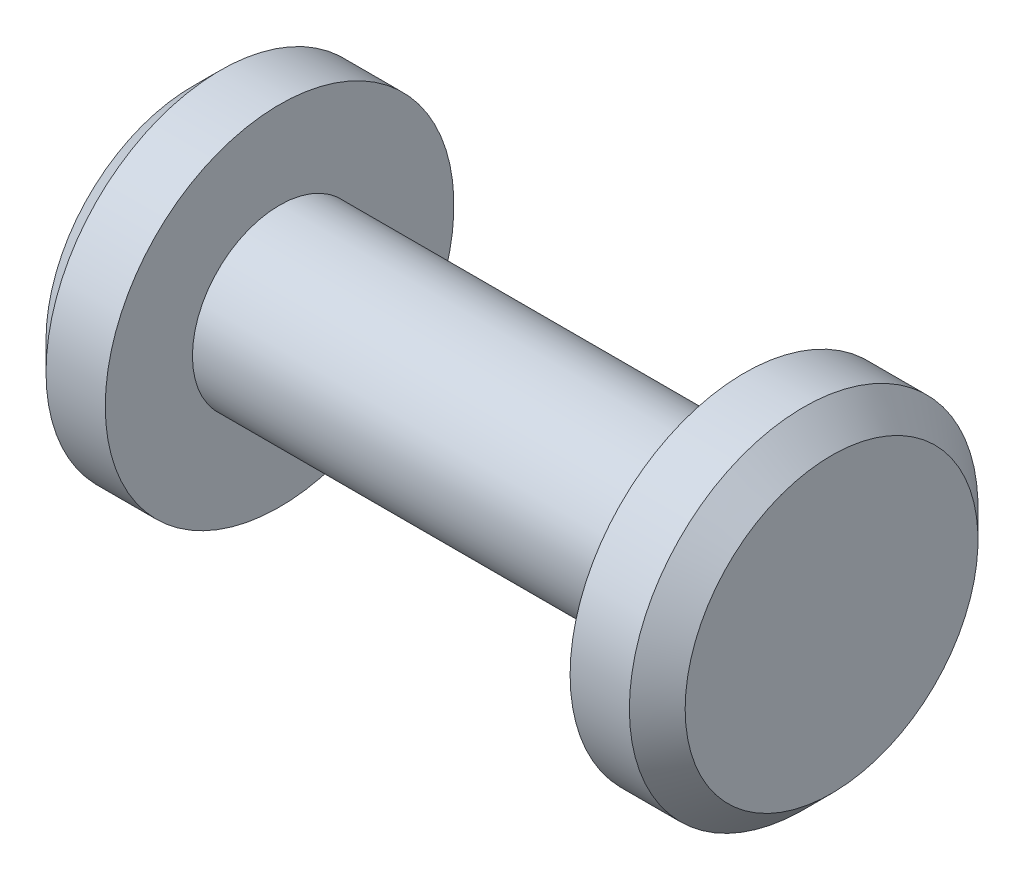
ISO-10303-21;
HEADER;
FILE_DESCRIPTION(('STEP AP214'),'2;1');
FILE_NAME('part.step','',(''),(''),'','','');
FILE_SCHEMA(('AUTOMOTIVE_DESIGN { 1 0 10303 214 1 1 1 1 }'));
ENDSEC;
DATA;
#1=APPLICATION_CONTEXT('core data for automotive mechanical design processes');
#2=APPLICATION_PROTOCOL_DEFINITION('international standard','automotive_design',2000,#1);
#3=PRODUCT_CONTEXT('',#1,'mechanical');
#4=PRODUCT('Part','Part','',(#3));
#5=PRODUCT_RELATED_PRODUCT_CATEGORY('part','',(#4));
#6=PRODUCT_DEFINITION_FORMATION('','',#4);
#7=PRODUCT_DEFINITION_CONTEXT('part definition',#1,'design');
#8=PRODUCT_DEFINITION('design','',#6,#7);
#9=PRODUCT_DEFINITION_SHAPE('','',#8);
#10=(LENGTH_UNIT() NAMED_UNIT(*) SI_UNIT(.MILLI.,.METRE.));
#11=(NAMED_UNIT(*) PLANE_ANGLE_UNIT() SI_UNIT($,.RADIAN.));
#12=(NAMED_UNIT(*) SI_UNIT($,.STERADIAN.) SOLID_ANGLE_UNIT());
#13=UNCERTAINTY_MEASURE_WITH_UNIT(LENGTH_MEASURE(1.E-05),#10,'distance_accuracy_value','');
#14=(GEOMETRIC_REPRESENTATION_CONTEXT(3) GLOBAL_UNCERTAINTY_ASSIGNED_CONTEXT((#13)) GLOBAL_UNIT_ASSIGNED_CONTEXT((#10,
#11,#12)) REPRESENTATION_CONTEXT('',''));
#15=CARTESIAN_POINT('',(0.,0.,0.));
#16=DIRECTION('',(0.,0.,1.));
#17=DIRECTION('',(1.,0.,0.));
#18=AXIS2_PLACEMENT_3D('',#15,#16,#17);
#19=CARTESIAN_POINT('',(0.,0.,0.));
#20=DIRECTION('',(-1.,0.,0.));
#21=DIRECTION('',(0.,0.,1.));
#22=AXIS2_PLACEMENT_3D('',#19,#20,#21);
#23=CYLINDRICAL_SURFACE('',#22,4.7625);
#24=CARTESIAN_POINT('',(7.96924999999999,0.,0.));
#25=DIRECTION('',(-1.,0.,0.));
#26=DIRECTION('',(0.,0.,1.));
#27=AXIS2_PLACEMENT_3D('',#24,#25,#26);
#28=CIRCLE('',#27,4.7625);
#29=CARTESIAN_POINT('',(7.96924999999999,0.,4.76250000000001));
#30=VERTEX_POINT('',#29);
#31=EDGE_CURVE('E46',#30,#30,#28,.T.);
#32=ORIENTED_EDGE('',*,*,#31,.T.);
#33=EDGE_LOOP('',(#32));
#34=FACE_BOUND('',#33,.T.);
#35=CARTESIAN_POINT('',(6.35,0.,0.));
#36=DIRECTION('',(-1.,0.,0.));
#37=DIRECTION('',(0.,0.,1.));
#38=AXIS2_PLACEMENT_3D('',#35,#36,#37);
#39=CIRCLE('',#38,4.7625);
#40=CARTESIAN_POINT('',(6.35,0.,4.76250000000001));
#41=VERTEX_POINT('',#40);
#42=EDGE_CURVE('E51',#41,#41,#39,.T.);
#43=ORIENTED_EDGE('',*,*,#42,.F.);
#44=EDGE_LOOP('',(#43));
#45=FACE_BOUND('',#44,.T.);
#46=ADVANCED_FACE('F32',(#34,#45),#23,.T.);
#47=CARTESIAN_POINT('',(6.34999999999999,4.7625,0.));
#48=DIRECTION('',(1.,0.,0.));
#49=DIRECTION('',(0.,0.,-1.));
#50=AXIS2_PLACEMENT_3D('',#47,#48,#49);
#51=PLANE('',#50);
#52=CARTESIAN_POINT('',(6.34999999999999,0.,0.));
#53=DIRECTION('',(-1.,0.,0.));
#54=DIRECTION('',(0.,0.,1.));
#55=AXIS2_PLACEMENT_3D('',#52,#53,#54);
#56=CIRCLE('',#55,2.38125);
#57=CARTESIAN_POINT('',(6.34999999999999,0.,2.38125));
#58=VERTEX_POINT('',#57);
#59=EDGE_CURVE('E54',#58,#58,#56,.T.);
#60=ORIENTED_EDGE('',*,*,#59,.F.);
#61=EDGE_LOOP('',(#60));
#62=FACE_BOUND('',#61,.T.);
#63=ORIENTED_EDGE('',*,*,#42,.T.);
#64=EDGE_LOOP('',(#63));
#65=FACE_BOUND('',#64,.T.);
#66=ADVANCED_FACE('F77',(#62,#65),#51,.F.);
#67=CARTESIAN_POINT('',(0.,0.,0.));
#68=DIRECTION('',(-1.,0.,0.));
#69=DIRECTION('',(0.,0.,1.));
#70=AXIS2_PLACEMENT_3D('',#67,#68,#69);
#71=CYLINDRICAL_SURFACE('',#70,2.38125);
#72=CARTESIAN_POINT('',(-6.35000000000001,0.,0.));
#73=DIRECTION('',(-1.,0.,0.));
#74=DIRECTION('',(0.,0.,1.));
#75=AXIS2_PLACEMENT_3D('',#72,#73,#74);
#76=CIRCLE('',#75,2.38124999999999);
#77=CARTESIAN_POINT('',(-6.35000000000001,0.,2.38125));
#78=VERTEX_POINT('',#77);
#79=EDGE_CURVE('E57',#78,#78,#76,.T.);
#80=ORIENTED_EDGE('',*,*,#79,.F.);
#81=EDGE_LOOP('',(#80));
#82=FACE_BOUND('',#81,.T.);
#83=ORIENTED_EDGE('',*,*,#59,.T.);
#84=EDGE_LOOP('',(#83));
#85=FACE_BOUND('',#84,.T.);
#86=ADVANCED_FACE('F68',(#82,#85),#71,.T.);
#87=CARTESIAN_POINT('',(-6.35000000000002,4.7625,0.));
#88=DIRECTION('',(1.,0.,0.));
#89=DIRECTION('',(0.,0.,-1.));
#90=AXIS2_PLACEMENT_3D('',#87,#88,#89);
#91=PLANE('',#90);
#92=ORIENTED_EDGE('',*,*,#79,.T.);
#93=EDGE_LOOP('',(#92));
#94=FACE_BOUND('',#93,.T.);
#95=CARTESIAN_POINT('',(-6.35000000000001,0.,0.));
#96=DIRECTION('',(-1.,0.,0.));
#97=DIRECTION('',(0.,0.,1.));
#98=AXIS2_PLACEMENT_3D('',#95,#96,#97);
#99=CIRCLE('',#98,4.7625);
#100=CARTESIAN_POINT('',(-6.35000000000001,0.,4.76250000000001));
#101=VERTEX_POINT('',#100);
#102=EDGE_CURVE('E60',#101,#101,#99,.T.);
#103=ORIENTED_EDGE('',*,*,#102,.F.);
#104=EDGE_LOOP('',(#103));
#105=FACE_BOUND('',#104,.T.);
#106=ADVANCED_FACE('F66',(#94,#105),#91,.T.);
#107=CARTESIAN_POINT('',(0.,0.,0.));
#108=DIRECTION('',(-1.,0.,0.));
#109=DIRECTION('',(0.,0.,1.));
#110=AXIS2_PLACEMENT_3D('',#107,#108,#109);
#111=CYLINDRICAL_SURFACE('',#110,4.7625);
#112=CARTESIAN_POINT('',(-7.96924999999999,0.,0.));
#113=DIRECTION('',(-1.,0.,0.));
#114=DIRECTION('',(0.,0.,1.));
#115=AXIS2_PLACEMENT_3D('',#112,#113,#114);
#116=CIRCLE('',#115,4.7625);
#117=CARTESIAN_POINT('',(-7.96924999999999,0.,4.76250000000001));
#118=VERTEX_POINT('',#117);
#119=EDGE_CURVE('E10',#118,#118,#116,.F.);
#120=ORIENTED_EDGE('',*,*,#119,.T.);
#121=EDGE_LOOP('',(#120));
#122=FACE_BOUND('',#121,.T.);
#123=ORIENTED_EDGE('',*,*,#102,.T.);
#124=EDGE_LOOP('',(#123));
#125=FACE_BOUND('',#124,.T.);
#126=ADVANCED_FACE('F64',(#122,#125),#111,.T.);
#127=CARTESIAN_POINT('',(-8.73125,0.,0.));
#128=DIRECTION('',(-1.,0.,0.));
#129=DIRECTION('',(0.,0.,1.));
#130=AXIS2_PLACEMENT_3D('',#127,#128,#129);
#131=PLANE('',#130);
#132=CARTESIAN_POINT('',(-8.73125,0.,0.));
#133=DIRECTION('',(-1.,0.,0.));
#134=DIRECTION('',(0.,0.,1.));
#135=AXIS2_PLACEMENT_3D('',#132,#133,#134);
#136=CIRCLE('',#135,4.00049999999999);
#137=CARTESIAN_POINT('',(-8.73125,0.,4.00049999999999));
#138=VERTEX_POINT('',#137);
#139=EDGE_CURVE('E38',#138,#138,#136,.T.);
#140=ORIENTED_EDGE('',*,*,#139,.T.);
#141=EDGE_LOOP('',(#140));
#142=FACE_BOUND('',#141,.T.);
#143=ADVANCED_FACE('F75',(#142),#131,.T.);
#144=CARTESIAN_POINT('',(8.73125,0.,0.));
#145=DIRECTION('',(-1.,0.,0.));
#146=DIRECTION('',(0.,0.,1.));
#147=AXIS2_PLACEMENT_3D('',#144,#145,#146);
#148=PLANE('',#147);
#149=CARTESIAN_POINT('',(8.73125,0.,0.));
#150=DIRECTION('',(-1.,0.,0.));
#151=DIRECTION('',(0.,0.,1.));
#152=AXIS2_PLACEMENT_3D('',#149,#150,#151);
#153=CIRCLE('',#152,4.00049999999999);
#154=CARTESIAN_POINT('',(8.73125,0.,4.0005));
#155=VERTEX_POINT('',#154);
#156=EDGE_CURVE('E42',#155,#155,#153,.F.);
#157=ORIENTED_EDGE('',*,*,#156,.T.);
#158=EDGE_LOOP('',(#157));
#159=FACE_BOUND('',#158,.T.);
#160=ADVANCED_FACE('F94',(#159),#148,.F.);
#161=CARTESIAN_POINT('',(7.96924999999999,0.,0.));
#162=DIRECTION('',(-1.,0.,0.));
#163=DIRECTION('',(0.,0.,1.));
#164=AXIS2_PLACEMENT_3D('',#161,#162,#163);
#165=CONICAL_SURFACE('',#164,4.7625,0.785398163397444);
#166=ORIENTED_EDGE('',*,*,#156,.F.);
#167=EDGE_LOOP('',(#166));
#168=FACE_BOUND('',#167,.T.);
#169=ORIENTED_EDGE('',*,*,#31,.F.);
#170=EDGE_LOOP('',(#169));
#171=FACE_BOUND('',#170,.T.);
#172=ADVANCED_FACE('F91',(#168,#171),#165,.T.);
#173=CARTESIAN_POINT('',(-8.73125,0.,0.));
#174=DIRECTION('',(1.,0.,0.));
#175=DIRECTION('',(0.,0.,-1.));
#176=AXIS2_PLACEMENT_3D('',#173,#174,#175);
#177=CONICAL_SURFACE('',#176,4.00049999999999,0.785398163397453);
#178=ORIENTED_EDGE('',*,*,#119,.F.);
#179=EDGE_LOOP('',(#178));
#180=FACE_BOUND('',#179,.T.);
#181=ORIENTED_EDGE('',*,*,#139,.F.);
#182=EDGE_LOOP('',(#181));
#183=FACE_BOUND('',#182,.T.);
#184=ADVANCED_FACE('F93',(#180,#183),#177,.T.);
#185=CLOSED_SHELL('',(#46,#66,#86,#106,#126,#143,#160,#172,#184));
#186=MANIFOLD_SOLID_BREP('B2',#185);
#187=ADVANCED_BREP_SHAPE_REPRESENTATION('',(#18,#186),#14);
#188=SHAPE_DEFINITION_REPRESENTATION(#9,#187);
ENDSEC;
END-ISO-10303-21;
